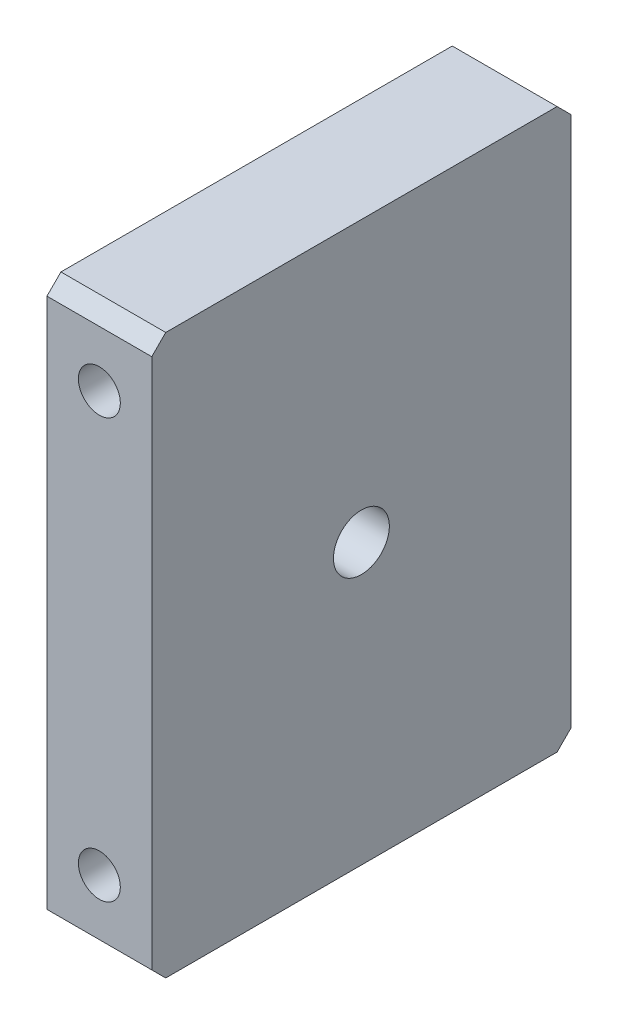
ISO-10303-21;
HEADER;
FILE_DESCRIPTION(('STEP AP214'),'2;1');
FILE_NAME('part.step','',(''),(''),'','','');
FILE_SCHEMA(('AUTOMOTIVE_DESIGN { 1 0 10303 214 1 1 1 1 }'));
ENDSEC;
DATA;
#1=APPLICATION_CONTEXT('core data for automotive mechanical design processes');
#2=APPLICATION_PROTOCOL_DEFINITION('international standard','automotive_design',2000,#1);
#3=PRODUCT_CONTEXT('',#1,'mechanical');
#4=PRODUCT('Part','Part','',(#3));
#5=PRODUCT_RELATED_PRODUCT_CATEGORY('part','',(#4));
#6=PRODUCT_DEFINITION_FORMATION('','',#4);
#7=PRODUCT_DEFINITION_CONTEXT('part definition',#1,'design');
#8=PRODUCT_DEFINITION('design','',#6,#7);
#9=PRODUCT_DEFINITION_SHAPE('','',#8);
#10=(LENGTH_UNIT() NAMED_UNIT(*) SI_UNIT(.MILLI.,.METRE.));
#11=(NAMED_UNIT(*) PLANE_ANGLE_UNIT() SI_UNIT($,.RADIAN.));
#12=(NAMED_UNIT(*) SI_UNIT($,.STERADIAN.) SOLID_ANGLE_UNIT());
#13=UNCERTAINTY_MEASURE_WITH_UNIT(LENGTH_MEASURE(1.E-05),#10,'distance_accuracy_value','');
#14=(GEOMETRIC_REPRESENTATION_CONTEXT(3) GLOBAL_UNCERTAINTY_ASSIGNED_CONTEXT((#13)) GLOBAL_UNIT_ASSIGNED_CONTEXT((#10,
#11,#12)) REPRESENTATION_CONTEXT('',''));
#15=CARTESIAN_POINT('',(0.,0.,0.));
#16=DIRECTION('',(0.,0.,1.));
#17=DIRECTION('',(1.,0.,0.));
#18=AXIS2_PLACEMENT_3D('',#15,#16,#17);
#19=CARTESIAN_POINT('',(19.05,0.,-76.2));
#20=DIRECTION('',(0.,1.,0.));
#21=DIRECTION('',(0.,0.,1.));
#22=AXIS2_PLACEMENT_3D('',#19,#20,#21);
#23=PLANE('',#22);
#24=DIRECTION('',(0.,0.,-1.));
#25=VECTOR('',#24,1.);
#26=CARTESIAN_POINT('',(0.,0.,-76.2));
#27=LINE('',#26,#25);
#28=CARTESIAN_POINT('',(0.,0.,-2.54000000000002));
#29=VERTEX_POINT('',#28);
#30=CARTESIAN_POINT('',(0.,0.,-73.66));
#31=VERTEX_POINT('',#30);
#32=EDGE_CURVE('E127',#29,#31,#27,.T.);
#33=ORIENTED_EDGE('',*,*,#32,.T.);
#34=DIRECTION('',(1.,0.,0.));
#35=VECTOR('',#34,1.);
#36=CARTESIAN_POINT('',(19.05,0.,-73.66));
#37=LINE('',#36,#35);
#38=CARTESIAN_POINT('',(19.05,0.,-73.66));
#39=VERTEX_POINT('',#38);
#40=EDGE_CURVE('E104',#31,#39,#37,.T.);
#41=ORIENTED_EDGE('',*,*,#40,.T.);
#42=DIRECTION('',(0.,0.,-1.));
#43=VECTOR('',#42,1.);
#44=CARTESIAN_POINT('',(19.05,0.,-76.2));
#45=LINE('',#44,#43);
#46=CARTESIAN_POINT('',(19.05,0.,-2.54000000000002));
#47=VERTEX_POINT('',#46);
#48=EDGE_CURVE('E137',#47,#39,#45,.T.);
#49=ORIENTED_EDGE('',*,*,#48,.F.);
#50=DIRECTION('',(-1.,0.,0.));
#51=VECTOR('',#50,1.);
#52=CARTESIAN_POINT('',(19.05,0.,-2.54000000000001));
#53=LINE('',#52,#51);
#54=EDGE_CURVE('E109',#47,#29,#53,.T.);
#55=ORIENTED_EDGE('',*,*,#54,.T.);
#56=EDGE_LOOP('',(#33,#41,#49,#55));
#57=FACE_BOUND('',#56,.T.);
#58=ADVANCED_FACE('F32',(#57),#23,.F.);
#59=CARTESIAN_POINT('',(19.05,101.6,-76.2));
#60=DIRECTION('',(0.,0.,1.));
#61=DIRECTION('',(0.,-1.,0.));
#62=AXIS2_PLACEMENT_3D('',#59,#60,#61);
#63=PLANE('',#62);
#64=CARTESIAN_POINT('',(9.525,88.9,-76.2));
#65=DIRECTION('',(0.,0.,1.));
#66=DIRECTION('',(1.,0.,0.));
#67=AXIS2_PLACEMENT_3D('',#64,#65,#66);
#68=CIRCLE('',#67,3.81);
#69=CARTESIAN_POINT('',(13.335,88.9,-76.2));
#70=VERTEX_POINT('',#69);
#71=EDGE_CURVE('E182',#70,#70,#68,.T.);
#72=ORIENTED_EDGE('',*,*,#71,.T.);
#73=EDGE_LOOP('',(#72));
#74=FACE_BOUND('',#73,.T.);
#75=CARTESIAN_POINT('',(9.525,12.7,-76.2));
#76=DIRECTION('',(0.,0.,1.));
#77=DIRECTION('',(1.,0.,0.));
#78=AXIS2_PLACEMENT_3D('',#75,#76,#77);
#79=CIRCLE('',#78,3.81);
#80=CARTESIAN_POINT('',(13.335,12.7,-76.2));
#81=VERTEX_POINT('',#80);
#82=EDGE_CURVE('E132',#81,#81,#79,.T.);
#83=ORIENTED_EDGE('',*,*,#82,.T.);
#84=EDGE_LOOP('',(#83));
#85=FACE_BOUND('',#84,.T.);
#86=DIRECTION('',(0.,1.,0.));
#87=VECTOR('',#86,1.);
#88=CARTESIAN_POINT('',(19.05,101.6,-76.2));
#89=LINE('',#88,#87);
#90=CARTESIAN_POINT('',(19.05,2.53999999999995,-76.2));
#91=VERTEX_POINT('',#90);
#92=CARTESIAN_POINT('',(19.05,99.06,-76.2));
#93=VERTEX_POINT('',#92);
#94=EDGE_CURVE('E119',#91,#93,#89,.T.);
#95=ORIENTED_EDGE('',*,*,#94,.F.);
#96=DIRECTION('',(-1.,0.,0.));
#97=VECTOR('',#96,1.);
#98=CARTESIAN_POINT('',(19.05,2.53999999999997,-76.2));
#99=LINE('',#98,#97);
#100=CARTESIAN_POINT('',(0.,2.53999999999997,-76.2));
#101=VERTEX_POINT('',#100);
#102=EDGE_CURVE('E103',#91,#101,#99,.T.);
#103=ORIENTED_EDGE('',*,*,#102,.T.);
#104=DIRECTION('',(0.,1.,0.));
#105=VECTOR('',#104,1.);
#106=CARTESIAN_POINT('',(0.,101.6,-76.2));
#107=LINE('',#106,#105);
#108=CARTESIAN_POINT('',(0.,99.06,-76.2));
#109=VERTEX_POINT('',#108);
#110=EDGE_CURVE('E116',#101,#109,#107,.T.);
#111=ORIENTED_EDGE('',*,*,#110,.T.);
#112=DIRECTION('',(1.,0.,0.));
#113=VECTOR('',#112,1.);
#114=CARTESIAN_POINT('',(19.05,99.06,-76.2));
#115=LINE('',#114,#113);
#116=EDGE_CURVE('E121',#109,#93,#115,.T.);
#117=ORIENTED_EDGE('',*,*,#116,.T.);
#118=EDGE_LOOP('',(#95,#103,#111,#117));
#119=FACE_BOUND('',#118,.T.);
#120=ADVANCED_FACE('F115',(#74,#85,#119),#63,.F.);
#121=CARTESIAN_POINT('',(19.05,101.6,0.));
#122=DIRECTION('',(0.,-1.,0.));
#123=DIRECTION('',(0.,0.,-1.));
#124=AXIS2_PLACEMENT_3D('',#121,#122,#123);
#125=PLANE('',#124);
#126=DIRECTION('',(0.,0.,1.));
#127=VECTOR('',#126,1.);
#128=CARTESIAN_POINT('',(19.05,101.6,0.));
#129=LINE('',#128,#127);
#130=CARTESIAN_POINT('',(19.05,101.6,-73.66));
#131=VERTEX_POINT('',#130);
#132=CARTESIAN_POINT('',(19.05,101.6,-2.54000000000001));
#133=VERTEX_POINT('',#132);
#134=EDGE_CURVE('E160',#131,#133,#129,.T.);
#135=ORIENTED_EDGE('',*,*,#134,.F.);
#136=DIRECTION('',(-1.,0.,0.));
#137=VECTOR('',#136,1.);
#138=CARTESIAN_POINT('',(19.05,101.6,-73.66));
#139=LINE('',#138,#137);
#140=CARTESIAN_POINT('',(0.,101.6,-73.66));
#141=VERTEX_POINT('',#140);
#142=EDGE_CURVE('E11',#131,#141,#139,.T.);
#143=ORIENTED_EDGE('',*,*,#142,.T.);
#144=DIRECTION('',(0.,0.,1.));
#145=VECTOR('',#144,1.);
#146=CARTESIAN_POINT('',(0.,101.6,0.));
#147=LINE('',#146,#145);
#148=CARTESIAN_POINT('',(0.,101.6,-2.54000000000003));
#149=VERTEX_POINT('',#148);
#150=EDGE_CURVE('E126',#141,#149,#147,.T.);
#151=ORIENTED_EDGE('',*,*,#150,.T.);
#152=DIRECTION('',(1.,0.,0.));
#153=VECTOR('',#152,1.);
#154=CARTESIAN_POINT('',(19.05,101.6,-2.54000000000003));
#155=LINE('',#154,#153);
#156=EDGE_CURVE('E40',#149,#133,#155,.T.);
#157=ORIENTED_EDGE('',*,*,#156,.T.);
#158=EDGE_LOOP('',(#135,#143,#151,#157));
#159=FACE_BOUND('',#158,.T.);
#160=ADVANCED_FACE('F159',(#159),#125,.F.);
#161=CARTESIAN_POINT('',(19.05,101.6,0.));
#162=DIRECTION('',(0.,0.,-1.));
#163=DIRECTION('',(-1.,0.,0.));
#164=AXIS2_PLACEMENT_3D('',#161,#162,#163);
#165=PLANE('',#164);
#166=CARTESIAN_POINT('',(9.525,88.9,0.));
#167=DIRECTION('',(0.,0.,1.));
#168=DIRECTION('',(1.,0.,0.));
#169=AXIS2_PLACEMENT_3D('',#166,#167,#168);
#170=CIRCLE('',#169,3.81);
#171=CARTESIAN_POINT('',(13.335,88.9,0.));
#172=VERTEX_POINT('',#171);
#173=EDGE_CURVE('E185',#172,#172,#170,.T.);
#174=ORIENTED_EDGE('',*,*,#173,.F.);
#175=EDGE_LOOP('',(#174));
#176=FACE_BOUND('',#175,.T.);
#177=CARTESIAN_POINT('',(9.525,12.7,0.));
#178=DIRECTION('',(0.,0.,1.));
#179=DIRECTION('',(1.,0.,0.));
#180=AXIS2_PLACEMENT_3D('',#177,#178,#179);
#181=CIRCLE('',#180,3.81);
#182=CARTESIAN_POINT('',(13.335,12.7,0.));
#183=VERTEX_POINT('',#182);
#184=EDGE_CURVE('E179',#183,#183,#181,.T.);
#185=ORIENTED_EDGE('',*,*,#184,.F.);
#186=EDGE_LOOP('',(#185));
#187=FACE_BOUND('',#186,.T.);
#188=DIRECTION('',(0.,-1.,0.));
#189=VECTOR('',#188,1.);
#190=CARTESIAN_POINT('',(0.,101.6,0.));
#191=LINE('',#190,#189);
#192=CARTESIAN_POINT('',(0.,99.06,0.));
#193=VERTEX_POINT('',#192);
#194=CARTESIAN_POINT('',(0.,2.54,0.));
#195=VERTEX_POINT('',#194);
#196=EDGE_CURVE('E130',#193,#195,#191,.T.);
#197=ORIENTED_EDGE('',*,*,#196,.T.);
#198=DIRECTION('',(1.,0.,0.));
#199=VECTOR('',#198,1.);
#200=CARTESIAN_POINT('',(19.05,2.54,0.));
#201=LINE('',#200,#199);
#202=CARTESIAN_POINT('',(19.05,2.54000000000001,0.));
#203=VERTEX_POINT('',#202);
#204=EDGE_CURVE('E47',#195,#203,#201,.T.);
#205=ORIENTED_EDGE('',*,*,#204,.T.);
#206=DIRECTION('',(0.,-1.,0.));
#207=VECTOR('',#206,1.);
#208=CARTESIAN_POINT('',(19.05,101.6,0.));
#209=LINE('',#208,#207);
#210=CARTESIAN_POINT('',(19.05,99.06,0.));
#211=VERTEX_POINT('',#210);
#212=EDGE_CURVE('E138',#211,#203,#209,.T.);
#213=ORIENTED_EDGE('',*,*,#212,.F.);
#214=DIRECTION('',(-1.,0.,0.));
#215=VECTOR('',#214,1.);
#216=CARTESIAN_POINT('',(19.05,99.06,0.));
#217=LINE('',#216,#215);
#218=EDGE_CURVE('E153',#211,#193,#217,.T.);
#219=ORIENTED_EDGE('',*,*,#218,.T.);
#220=EDGE_LOOP('',(#197,#205,#213,#219));
#221=FACE_BOUND('',#220,.T.);
#222=ADVANCED_FACE('F169',(#176,#187,#221),#165,.F.);
#223=CARTESIAN_POINT('',(19.05,0.,0.));
#224=DIRECTION('',(1.,0.,0.));
#225=DIRECTION('',(0.,0.,-1.));
#226=AXIS2_PLACEMENT_3D('',#223,#224,#225);
#227=PLANE('',#226);
#228=CARTESIAN_POINT('',(19.05,50.8,-38.1));
#229=DIRECTION('',(1.,0.,0.));
#230=DIRECTION('',(0.,0.,-1.));
#231=AXIS2_PLACEMENT_3D('',#228,#229,#230);
#232=CIRCLE('',#231,5.08000000000001);
#233=CARTESIAN_POINT('',(19.05,50.8,-43.18));
#234=VERTEX_POINT('',#233);
#235=EDGE_CURVE('E191',#234,#234,#232,.T.);
#236=ORIENTED_EDGE('',*,*,#235,.F.);
#237=EDGE_LOOP('',(#236));
#238=FACE_BOUND('',#237,.T.);
#239=ORIENTED_EDGE('',*,*,#48,.T.);
#240=DIRECTION('',(0.,-0.707106781186543,0.707106781186552));
#241=VECTOR('',#240,1.);
#242=CARTESIAN_POINT('',(19.05,-36.83,-36.8299999999995));
#243=LINE('',#242,#241);
#244=EDGE_CURVE('E151',#39,#91,#243,.F.);
#245=ORIENTED_EDGE('',*,*,#244,.T.);
#246=ORIENTED_EDGE('',*,*,#94,.T.);
#247=DIRECTION('',(0.,-0.70710678118655,-0.707106781186546));
#248=VECTOR('',#247,1.);
#249=CARTESIAN_POINT('',(19.05,87.6299999999997,-87.6300000000002));
#250=LINE('',#249,#248);
#251=EDGE_CURVE('E147',#93,#131,#250,.F.);
#252=ORIENTED_EDGE('',*,*,#251,.T.);
#253=ORIENTED_EDGE('',*,*,#134,.T.);
#254=DIRECTION('',(0.,0.707106781186546,-0.707106781186549));
#255=VECTOR('',#254,1.);
#256=CARTESIAN_POINT('',(19.05,49.5300000000002,49.53));
#257=LINE('',#256,#255);
#258=EDGE_CURVE('E54',#133,#211,#257,.F.);
#259=ORIENTED_EDGE('',*,*,#258,.T.);
#260=ORIENTED_EDGE('',*,*,#212,.T.);
#261=DIRECTION('',(0.,0.707106781186546,0.70710678118655));
#262=VECTOR('',#261,1.);
#263=CARTESIAN_POINT('',(19.05,1.27000000000001,-1.27));
#264=LINE('',#263,#262);
#265=EDGE_CURVE('E149',#203,#47,#264,.F.);
#266=ORIENTED_EDGE('',*,*,#265,.T.);
#267=EDGE_LOOP('',(#239,#245,#246,#252,#253,#259,#260,#266));
#268=FACE_BOUND('',#267,.T.);
#269=ADVANCED_FACE('F164',(#238,#268),#227,.T.);
#270=CARTESIAN_POINT('',(0.,0.,0.));
#271=DIRECTION('',(1.,0.,0.));
#272=DIRECTION('',(0.,0.,-1.));
#273=AXIS2_PLACEMENT_3D('',#270,#271,#272);
#274=PLANE('',#273);
#275=CARTESIAN_POINT('',(0.,50.8,-38.1));
#276=DIRECTION('',(1.,0.,0.));
#277=DIRECTION('',(0.,0.,-1.));
#278=AXIS2_PLACEMENT_3D('',#275,#276,#277);
#279=CIRCLE('',#278,5.08000000000001);
#280=CARTESIAN_POINT('',(0.,50.8,-43.18));
#281=VERTEX_POINT('',#280);
#282=EDGE_CURVE('E188',#281,#281,#279,.T.);
#283=ORIENTED_EDGE('',*,*,#282,.T.);
#284=EDGE_LOOP('',(#283));
#285=FACE_BOUND('',#284,.T.);
#286=ORIENTED_EDGE('',*,*,#110,.F.);
#287=DIRECTION('',(0.,0.707106781186543,-0.707106781186552));
#288=VECTOR('',#287,1.);
#289=CARTESIAN_POINT('',(0.,2.53999999999997,-76.2));
#290=LINE('',#289,#288);
#291=EDGE_CURVE('E99',#101,#31,#290,.F.);
#292=ORIENTED_EDGE('',*,*,#291,.T.);
#293=ORIENTED_EDGE('',*,*,#32,.F.);
#294=DIRECTION('',(0.,-0.707106781186546,-0.70710678118655));
#295=VECTOR('',#294,1.);
#296=CARTESIAN_POINT('',(0.,0.,-2.54000000000001));
#297=LINE('',#296,#295);
#298=EDGE_CURVE('E110',#29,#195,#297,.F.);
#299=ORIENTED_EDGE('',*,*,#298,.T.);
#300=ORIENTED_EDGE('',*,*,#196,.F.);
#301=DIRECTION('',(0.,-0.707106781186546,0.707106781186549));
#302=VECTOR('',#301,1.);
#303=CARTESIAN_POINT('',(0.,99.06,0.));
#304=LINE('',#303,#302);
#305=EDGE_CURVE('E120',#193,#149,#304,.F.);
#306=ORIENTED_EDGE('',*,*,#305,.T.);
#307=ORIENTED_EDGE('',*,*,#150,.F.);
#308=DIRECTION('',(0.,0.70710678118655,0.707106781186546));
#309=VECTOR('',#308,1.);
#310=CARTESIAN_POINT('',(0.,101.6,-73.66));
#311=LINE('',#310,#309);
#312=EDGE_CURVE('E125',#141,#109,#311,.F.);
#313=ORIENTED_EDGE('',*,*,#312,.T.);
#314=EDGE_LOOP('',(#286,#292,#293,#299,#300,#306,#307,#313));
#315=FACE_BOUND('',#314,.T.);
#316=ADVANCED_FACE('F123',(#285,#315),#274,.F.);
#317=CARTESIAN_POINT('',(9.525,12.7,-76.2));
#318=DIRECTION('',(0.,0.,1.));
#319=DIRECTION('',(1.,0.,0.));
#320=AXIS2_PLACEMENT_3D('',#317,#318,#319);
#321=CYLINDRICAL_SURFACE('',#320,3.81);
#322=ORIENTED_EDGE('',*,*,#82,.F.);
#323=EDGE_LOOP('',(#322));
#324=FACE_BOUND('',#323,.T.);
#325=ORIENTED_EDGE('',*,*,#184,.T.);
#326=EDGE_LOOP('',(#325));
#327=FACE_BOUND('',#326,.T.);
#328=ADVANCED_FACE('F211',(#324,#327),#321,.F.);
#329=CARTESIAN_POINT('',(9.525,88.9,-76.2));
#330=DIRECTION('',(0.,0.,1.));
#331=DIRECTION('',(1.,0.,0.));
#332=AXIS2_PLACEMENT_3D('',#329,#330,#331);
#333=CYLINDRICAL_SURFACE('',#332,3.81);
#334=ORIENTED_EDGE('',*,*,#71,.F.);
#335=EDGE_LOOP('',(#334));
#336=FACE_BOUND('',#335,.T.);
#337=ORIENTED_EDGE('',*,*,#173,.T.);
#338=EDGE_LOOP('',(#337));
#339=FACE_BOUND('',#338,.T.);
#340=ADVANCED_FACE('F201',(#336,#339),#333,.F.);
#341=CARTESIAN_POINT('',(0.,50.8,-38.1));
#342=DIRECTION('',(1.,0.,0.));
#343=DIRECTION('',(0.,0.,-1.));
#344=AXIS2_PLACEMENT_3D('',#341,#342,#343);
#345=CYLINDRICAL_SURFACE('',#344,5.08000000000001);
#346=ORIENTED_EDGE('',*,*,#282,.F.);
#347=EDGE_LOOP('',(#346));
#348=FACE_BOUND('',#347,.T.);
#349=ORIENTED_EDGE('',*,*,#235,.T.);
#350=EDGE_LOOP('',(#349));
#351=FACE_BOUND('',#350,.T.);
#352=ADVANCED_FACE('F198',(#348,#351),#345,.F.);
#353=CARTESIAN_POINT('',(19.05,2.53999999999997,-76.2));
#354=DIRECTION('',(0.,0.707106781186552,0.707106781186543));
#355=DIRECTION('',(0.,-0.707106781186543,0.707106781186552));
#356=AXIS2_PLACEMENT_3D('',#353,#354,#355);
#357=PLANE('',#356);
#358=ORIENTED_EDGE('',*,*,#244,.F.);
#359=ORIENTED_EDGE('',*,*,#40,.F.);
#360=ORIENTED_EDGE('',*,*,#291,.F.);
#361=ORIENTED_EDGE('',*,*,#102,.F.);
#362=EDGE_LOOP('',(#358,#359,#360,#361));
#363=FACE_BOUND('',#362,.T.);
#364=ADVANCED_FACE('F102',(#363),#357,.F.);
#365=CARTESIAN_POINT('',(19.05,0.,-2.54000000000001));
#366=DIRECTION('',(0.,0.70710678118655,-0.707106781186546));
#367=DIRECTION('',(0.,0.707106781186546,0.70710678118655));
#368=AXIS2_PLACEMENT_3D('',#365,#366,#367);
#369=PLANE('',#368);
#370=ORIENTED_EDGE('',*,*,#265,.F.);
#371=ORIENTED_EDGE('',*,*,#204,.F.);
#372=ORIENTED_EDGE('',*,*,#298,.F.);
#373=ORIENTED_EDGE('',*,*,#54,.F.);
#374=EDGE_LOOP('',(#370,#371,#372,#373));
#375=FACE_BOUND('',#374,.T.);
#376=ADVANCED_FACE('F173',(#375),#369,.F.);
#377=CARTESIAN_POINT('',(19.05,101.6,-73.66));
#378=DIRECTION('',(0.,-0.707106781186546,0.70710678118655));
#379=DIRECTION('',(0.,-0.70710678118655,-0.707106781186546));
#380=AXIS2_PLACEMENT_3D('',#377,#378,#379);
#381=PLANE('',#380);
#382=ORIENTED_EDGE('',*,*,#251,.F.);
#383=ORIENTED_EDGE('',*,*,#116,.F.);
#384=ORIENTED_EDGE('',*,*,#312,.F.);
#385=ORIENTED_EDGE('',*,*,#142,.F.);
#386=EDGE_LOOP('',(#382,#383,#384,#385));
#387=FACE_BOUND('',#386,.T.);
#388=ADVANCED_FACE('F228',(#387),#381,.F.);
#389=CARTESIAN_POINT('',(19.05,99.06,0.));
#390=DIRECTION('',(0.,-0.707106781186549,-0.707106781186546));
#391=DIRECTION('',(0.,0.707106781186546,-0.707106781186549));
#392=AXIS2_PLACEMENT_3D('',#389,#390,#391);
#393=PLANE('',#392);
#394=ORIENTED_EDGE('',*,*,#258,.F.);
#395=ORIENTED_EDGE('',*,*,#156,.F.);
#396=ORIENTED_EDGE('',*,*,#305,.F.);
#397=ORIENTED_EDGE('',*,*,#218,.F.);
#398=EDGE_LOOP('',(#394,#395,#396,#397));
#399=FACE_BOUND('',#398,.T.);
#400=ADVANCED_FACE('F34',(#399),#393,.F.);
#401=CLOSED_SHELL('',(#58,#120,#160,#222,#269,#316,#328,#340,#352,#364,#376,#388,#400));
#402=MANIFOLD_SOLID_BREP('B2',#401);
#403=ADVANCED_BREP_SHAPE_REPRESENTATION('',(#18,#402),#14);
#404=SHAPE_DEFINITION_REPRESENTATION(#9,#403);
ENDSEC;
END-ISO-10303-21;
